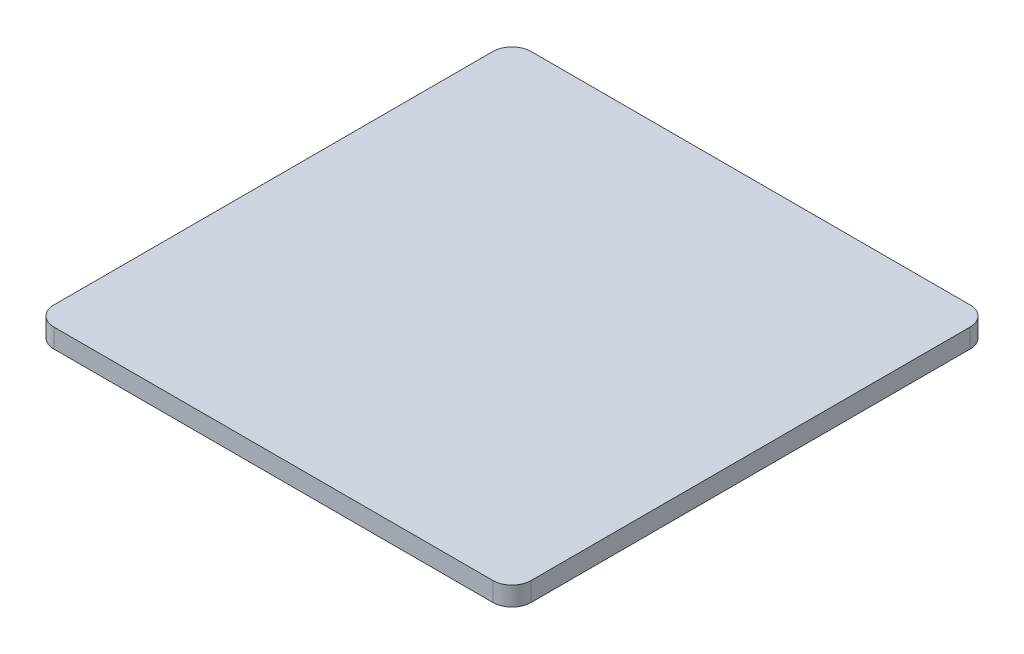
ISO-10303-21;
HEADER;
FILE_DESCRIPTION(('STEP AP214'),'2;1');
FILE_NAME('part.step','',(''),(''),'','','');
FILE_SCHEMA(('AUTOMOTIVE_DESIGN { 1 0 10303 214 1 1 1 1 }'));
ENDSEC;
DATA;
#1=APPLICATION_CONTEXT('core data for automotive mechanical design processes');
#2=APPLICATION_PROTOCOL_DEFINITION('international standard','automotive_design',2000,#1);
#3=PRODUCT_CONTEXT('',#1,'mechanical');
#4=PRODUCT('Part','Part','',(#3));
#5=PRODUCT_RELATED_PRODUCT_CATEGORY('part','',(#4));
#6=PRODUCT_DEFINITION_FORMATION('','',#4);
#7=PRODUCT_DEFINITION_CONTEXT('part definition',#1,'design');
#8=PRODUCT_DEFINITION('design','',#6,#7);
#9=PRODUCT_DEFINITION_SHAPE('','',#8);
#10=(LENGTH_UNIT() NAMED_UNIT(*) SI_UNIT(.MILLI.,.METRE.));
#11=(NAMED_UNIT(*) PLANE_ANGLE_UNIT() SI_UNIT($,.RADIAN.));
#12=(NAMED_UNIT(*) SI_UNIT($,.STERADIAN.) SOLID_ANGLE_UNIT());
#13=UNCERTAINTY_MEASURE_WITH_UNIT(LENGTH_MEASURE(1.E-05),#10,'distance_accuracy_value','');
#14=(GEOMETRIC_REPRESENTATION_CONTEXT(3) GLOBAL_UNCERTAINTY_ASSIGNED_CONTEXT((#13)) GLOBAL_UNIT_ASSIGNED_CONTEXT((#10,
#11,#12)) REPRESENTATION_CONTEXT('',''));
#15=CARTESIAN_POINT('',(0.,0.,0.));
#16=DIRECTION('',(0.,0.,1.));
#17=DIRECTION('',(1.,0.,0.));
#18=AXIS2_PLACEMENT_3D('',#15,#16,#17);
#19=CARTESIAN_POINT('',(-63.5,5.08,63.5));
#20=DIRECTION('',(1.,0.,0.));
#21=DIRECTION('',(0.,0.,-1.));
#22=AXIS2_PLACEMENT_3D('',#19,#20,#21);
#23=PLANE('',#22);
#24=DIRECTION('',(0.,0.,1.));
#25=VECTOR('',#24,1.);
#26=CARTESIAN_POINT('',(-63.5,5.08,63.5));
#27=LINE('',#26,#25);
#28=CARTESIAN_POINT('',(-63.5,5.08,-58.42));
#29=VERTEX_POINT('',#28);
#30=CARTESIAN_POINT('',(-63.5,5.08,58.42));
#31=VERTEX_POINT('',#30);
#32=EDGE_CURVE('E119',#29,#31,#27,.T.);
#33=ORIENTED_EDGE('',*,*,#32,.F.);
#34=DIRECTION('',(0.,-1.,0.));
#35=VECTOR('',#34,1.);
#36=CARTESIAN_POINT('',(-63.5,5.08,-58.42));
#37=LINE('',#36,#35);
#38=CARTESIAN_POINT('',(-63.5,0.,-58.42));
#39=VERTEX_POINT('',#38);
#40=EDGE_CURVE('E104',#29,#39,#37,.T.);
#41=ORIENTED_EDGE('',*,*,#40,.T.);
#42=DIRECTION('',(0.,0.,1.));
#43=VECTOR('',#42,1.);
#44=CARTESIAN_POINT('',(-63.5,0.,63.5));
#45=LINE('',#44,#43);
#46=CARTESIAN_POINT('',(-63.5,0.,58.42));
#47=VERTEX_POINT('',#46);
#48=EDGE_CURVE('E116',#39,#47,#45,.T.);
#49=ORIENTED_EDGE('',*,*,#48,.T.);
#50=DIRECTION('',(0.,-1.,0.));
#51=VECTOR('',#50,1.);
#52=CARTESIAN_POINT('',(-63.5,5.08,58.42));
#53=LINE('',#52,#51);
#54=EDGE_CURVE('E121',#47,#31,#53,.F.);
#55=ORIENTED_EDGE('',*,*,#54,.T.);
#56=EDGE_LOOP('',(#33,#41,#49,#55));
#57=FACE_BOUND('',#56,.T.);
#58=ADVANCED_FACE('F33',(#57),#23,.F.);
#59=CARTESIAN_POINT('',(63.5,5.08,63.5));
#60=DIRECTION('',(0.,0.,-1.));
#61=DIRECTION('',(-1.,0.,0.));
#62=AXIS2_PLACEMENT_3D('',#59,#60,#61);
#63=PLANE('',#62);
#64=DIRECTION('',(1.,0.,0.));
#65=VECTOR('',#64,1.);
#66=CARTESIAN_POINT('',(63.5,5.08,63.5));
#67=LINE('',#66,#65);
#68=CARTESIAN_POINT('',(-58.42,5.08,63.5));
#69=VERTEX_POINT('',#68);
#70=CARTESIAN_POINT('',(58.42,5.08,63.5));
#71=VERTEX_POINT('',#70);
#72=EDGE_CURVE('E159',#69,#71,#67,.T.);
#73=ORIENTED_EDGE('',*,*,#72,.F.);
#74=DIRECTION('',(0.,-1.,0.));
#75=VECTOR('',#74,1.);
#76=CARTESIAN_POINT('',(-58.42,5.08,63.5));
#77=LINE('',#76,#75);
#78=CARTESIAN_POINT('',(-58.42,0.,63.5));
#79=VERTEX_POINT('',#78);
#80=EDGE_CURVE('E11',#69,#79,#77,.T.);
#81=ORIENTED_EDGE('',*,*,#80,.T.);
#82=DIRECTION('',(1.,0.,0.));
#83=VECTOR('',#82,1.);
#84=CARTESIAN_POINT('',(63.5,0.,63.5));
#85=LINE('',#84,#83);
#86=CARTESIAN_POINT('',(58.42,0.,63.5));
#87=VERTEX_POINT('',#86);
#88=EDGE_CURVE('E126',#79,#87,#85,.T.);
#89=ORIENTED_EDGE('',*,*,#88,.T.);
#90=DIRECTION('',(0.,-1.,0.));
#91=VECTOR('',#90,1.);
#92=CARTESIAN_POINT('',(58.42,5.08,63.5));
#93=LINE('',#92,#91);
#94=EDGE_CURVE('E41',#87,#71,#93,.F.);
#95=ORIENTED_EDGE('',*,*,#94,.T.);
#96=EDGE_LOOP('',(#73,#81,#89,#95));
#97=FACE_BOUND('',#96,.T.);
#98=ADVANCED_FACE('F158',(#97),#63,.F.);
#99=CARTESIAN_POINT('',(63.5,5.08,63.5));
#100=DIRECTION('',(-1.,0.,0.));
#101=DIRECTION('',(0.,0.,1.));
#102=AXIS2_PLACEMENT_3D('',#99,#100,#101);
#103=PLANE('',#102);
#104=DIRECTION('',(0.,0.,-1.));
#105=VECTOR('',#104,1.);
#106=CARTESIAN_POINT('',(63.5,0.,63.5));
#107=LINE('',#106,#105);
#108=CARTESIAN_POINT('',(63.5,0.,58.42));
#109=VERTEX_POINT('',#108);
#110=CARTESIAN_POINT('',(63.5,0.,-58.42));
#111=VERTEX_POINT('',#110);
#112=EDGE_CURVE('E129',#109,#111,#107,.T.);
#113=ORIENTED_EDGE('',*,*,#112,.T.);
#114=DIRECTION('',(0.,-1.,0.));
#115=VECTOR('',#114,1.);
#116=CARTESIAN_POINT('',(63.5,5.08,-58.42));
#117=LINE('',#116,#115);
#118=CARTESIAN_POINT('',(63.5,5.08,-58.42));
#119=VERTEX_POINT('',#118);
#120=EDGE_CURVE('E48',#111,#119,#117,.F.);
#121=ORIENTED_EDGE('',*,*,#120,.T.);
#122=DIRECTION('',(0.,0.,-1.));
#123=VECTOR('',#122,1.);
#124=CARTESIAN_POINT('',(63.5,5.08,63.5));
#125=LINE('',#124,#123);
#126=CARTESIAN_POINT('',(63.5,5.08,58.42));
#127=VERTEX_POINT('',#126);
#128=EDGE_CURVE('E165',#127,#119,#125,.T.);
#129=ORIENTED_EDGE('',*,*,#128,.F.);
#130=DIRECTION('',(0.,-1.,0.));
#131=VECTOR('',#130,1.);
#132=CARTESIAN_POINT('',(63.5,5.08,58.42));
#133=LINE('',#132,#131);
#134=EDGE_CURVE('E152',#127,#109,#133,.T.);
#135=ORIENTED_EDGE('',*,*,#134,.T.);
#136=EDGE_LOOP('',(#113,#121,#129,#135));
#137=FACE_BOUND('',#136,.T.);
#138=ADVANCED_FACE('F169',(#137),#103,.F.);
#139=CARTESIAN_POINT('',(63.5,5.08,-63.5));
#140=DIRECTION('',(0.,0.,1.));
#141=DIRECTION('',(1.,0.,0.));
#142=AXIS2_PLACEMENT_3D('',#139,#140,#141);
#143=PLANE('',#142);
#144=DIRECTION('',(-1.,0.,0.));
#145=VECTOR('',#144,1.);
#146=CARTESIAN_POINT('',(63.5,0.,-63.5));
#147=LINE('',#146,#145);
#148=CARTESIAN_POINT('',(58.42,0.,-63.5));
#149=VERTEX_POINT('',#148);
#150=CARTESIAN_POINT('',(-58.42,0.,-63.5));
#151=VERTEX_POINT('',#150);
#152=EDGE_CURVE('E136',#149,#151,#147,.T.);
#153=ORIENTED_EDGE('',*,*,#152,.T.);
#154=DIRECTION('',(0.,-1.,0.));
#155=VECTOR('',#154,1.);
#156=CARTESIAN_POINT('',(-58.42,5.08,-63.5));
#157=LINE('',#156,#155);
#158=CARTESIAN_POINT('',(-58.42,5.08,-63.5));
#159=VERTEX_POINT('',#158);
#160=EDGE_CURVE('E105',#151,#159,#157,.F.);
#161=ORIENTED_EDGE('',*,*,#160,.T.);
#162=DIRECTION('',(-1.,0.,0.));
#163=VECTOR('',#162,1.);
#164=CARTESIAN_POINT('',(63.5,5.08,-63.5));
#165=LINE('',#164,#163);
#166=CARTESIAN_POINT('',(58.42,5.08,-63.5));
#167=VERTEX_POINT('',#166);
#168=EDGE_CURVE('E132',#167,#159,#165,.T.);
#169=ORIENTED_EDGE('',*,*,#168,.F.);
#170=DIRECTION('',(0.,-1.,0.));
#171=VECTOR('',#170,1.);
#172=CARTESIAN_POINT('',(58.42,5.08,-63.5));
#173=LINE('',#172,#171);
#174=EDGE_CURVE('E110',#167,#149,#173,.T.);
#175=ORIENTED_EDGE('',*,*,#174,.T.);
#176=EDGE_LOOP('',(#153,#161,#169,#175));
#177=FACE_BOUND('',#176,.T.);
#178=ADVANCED_FACE('F176',(#177),#143,.F.);
#179=CARTESIAN_POINT('',(0.,5.08,0.));
#180=DIRECTION('',(0.,1.,0.));
#181=DIRECTION('',(0.,0.,1.));
#182=AXIS2_PLACEMENT_3D('',#179,#180,#181);
#183=PLANE('',#182);
#184=ORIENTED_EDGE('',*,*,#168,.T.);
#185=CARTESIAN_POINT('',(-58.42,5.08,-58.42));
#186=DIRECTION('',(0.,1.,0.));
#187=DIRECTION('',(0.,0.,1.));
#188=AXIS2_PLACEMENT_3D('',#185,#186,#187);
#189=CIRCLE('',#188,5.08);
#190=EDGE_CURVE('E150',#159,#29,#189,.T.);
#191=ORIENTED_EDGE('',*,*,#190,.T.);
#192=ORIENTED_EDGE('',*,*,#32,.T.);
#193=CARTESIAN_POINT('',(-58.42,5.08,58.42));
#194=DIRECTION('',(0.,1.,0.));
#195=DIRECTION('',(0.,0.,1.));
#196=AXIS2_PLACEMENT_3D('',#193,#194,#195);
#197=CIRCLE('',#196,5.08);
#198=EDGE_CURVE('E146',#31,#69,#197,.T.);
#199=ORIENTED_EDGE('',*,*,#198,.T.);
#200=ORIENTED_EDGE('',*,*,#72,.T.);
#201=CARTESIAN_POINT('',(58.42,5.08,58.42));
#202=DIRECTION('',(0.,1.,0.));
#203=DIRECTION('',(0.,0.,1.));
#204=AXIS2_PLACEMENT_3D('',#201,#202,#203);
#205=CIRCLE('',#204,5.08);
#206=EDGE_CURVE('E55',#71,#127,#205,.T.);
#207=ORIENTED_EDGE('',*,*,#206,.T.);
#208=ORIENTED_EDGE('',*,*,#128,.T.);
#209=CARTESIAN_POINT('',(58.42,5.08,-58.42));
#210=DIRECTION('',(0.,1.,0.));
#211=DIRECTION('',(0.,0.,1.));
#212=AXIS2_PLACEMENT_3D('',#209,#210,#211);
#213=CIRCLE('',#212,5.08);
#214=EDGE_CURVE('E148',#119,#167,#213,.T.);
#215=ORIENTED_EDGE('',*,*,#214,.T.);
#216=EDGE_LOOP('',(#184,#191,#192,#199,#200,#207,#208,#215));
#217=FACE_BOUND('',#216,.T.);
#218=ADVANCED_FACE('F163',(#217),#183,.T.);
#219=CARTESIAN_POINT('',(0.,0.,0.));
#220=DIRECTION('',(0.,1.,0.));
#221=DIRECTION('',(0.,0.,1.));
#222=AXIS2_PLACEMENT_3D('',#219,#220,#221);
#223=PLANE('',#222);
#224=ORIENTED_EDGE('',*,*,#48,.F.);
#225=CARTESIAN_POINT('',(-58.42,0.,-58.42));
#226=DIRECTION('',(0.,1.,0.));
#227=DIRECTION('',(0.,0.,1.));
#228=AXIS2_PLACEMENT_3D('',#225,#226,#227);
#229=CIRCLE('',#228,5.08);
#230=EDGE_CURVE('E100',#39,#151,#229,.F.);
#231=ORIENTED_EDGE('',*,*,#230,.T.);
#232=ORIENTED_EDGE('',*,*,#152,.F.);
#233=CARTESIAN_POINT('',(58.42,0.,-58.42));
#234=DIRECTION('',(0.,1.,0.));
#235=DIRECTION('',(0.,0.,1.));
#236=AXIS2_PLACEMENT_3D('',#233,#234,#235);
#237=CIRCLE('',#236,5.08);
#238=EDGE_CURVE('E111',#149,#111,#237,.F.);
#239=ORIENTED_EDGE('',*,*,#238,.T.);
#240=ORIENTED_EDGE('',*,*,#112,.F.);
#241=CARTESIAN_POINT('',(58.42,0.,58.42));
#242=DIRECTION('',(0.,1.,0.));
#243=DIRECTION('',(0.,0.,1.));
#244=AXIS2_PLACEMENT_3D('',#241,#242,#243);
#245=CIRCLE('',#244,5.08);
#246=EDGE_CURVE('E120',#109,#87,#245,.F.);
#247=ORIENTED_EDGE('',*,*,#246,.T.);
#248=ORIENTED_EDGE('',*,*,#88,.F.);
#249=CARTESIAN_POINT('',(-58.42,0.,58.42));
#250=DIRECTION('',(0.,1.,0.));
#251=DIRECTION('',(0.,0.,1.));
#252=AXIS2_PLACEMENT_3D('',#249,#250,#251);
#253=CIRCLE('',#252,5.08);
#254=EDGE_CURVE('E125',#79,#47,#253,.F.);
#255=ORIENTED_EDGE('',*,*,#254,.T.);
#256=EDGE_LOOP('',(#224,#231,#232,#239,#240,#247,#248,#255));
#257=FACE_BOUND('',#256,.T.);
#258=ADVANCED_FACE('F123',(#257),#223,.F.);
#259=CARTESIAN_POINT('',(-58.42,5.08,-58.42));
#260=DIRECTION('',(0.,-1.,0.));
#261=DIRECTION('',(0.,0.,-1.));
#262=AXIS2_PLACEMENT_3D('',#259,#260,#261);
#263=CYLINDRICAL_SURFACE('',#262,5.08);
#264=ORIENTED_EDGE('',*,*,#190,.F.);
#265=ORIENTED_EDGE('',*,*,#160,.F.);
#266=ORIENTED_EDGE('',*,*,#230,.F.);
#267=ORIENTED_EDGE('',*,*,#40,.F.);
#268=EDGE_LOOP('',(#264,#265,#266,#267));
#269=FACE_BOUND('',#268,.T.);
#270=ADVANCED_FACE('F103',(#269),#263,.T.);
#271=CARTESIAN_POINT('',(58.42,5.08,-58.42));
#272=DIRECTION('',(0.,-1.,0.));
#273=DIRECTION('',(0.,0.,-1.));
#274=AXIS2_PLACEMENT_3D('',#271,#272,#273);
#275=CYLINDRICAL_SURFACE('',#274,5.08);
#276=ORIENTED_EDGE('',*,*,#214,.F.);
#277=ORIENTED_EDGE('',*,*,#120,.F.);
#278=ORIENTED_EDGE('',*,*,#238,.F.);
#279=ORIENTED_EDGE('',*,*,#174,.F.);
#280=EDGE_LOOP('',(#276,#277,#278,#279));
#281=FACE_BOUND('',#280,.T.);
#282=ADVANCED_FACE('F173',(#281),#275,.T.);
#283=CARTESIAN_POINT('',(-58.42,5.08,58.42));
#284=DIRECTION('',(0.,-1.,0.));
#285=DIRECTION('',(0.,0.,-1.));
#286=AXIS2_PLACEMENT_3D('',#283,#284,#285);
#287=CYLINDRICAL_SURFACE('',#286,5.08);
#288=ORIENTED_EDGE('',*,*,#198,.F.);
#289=ORIENTED_EDGE('',*,*,#54,.F.);
#290=ORIENTED_EDGE('',*,*,#254,.F.);
#291=ORIENTED_EDGE('',*,*,#80,.F.);
#292=EDGE_LOOP('',(#288,#289,#290,#291));
#293=FACE_BOUND('',#292,.T.);
#294=ADVANCED_FACE('F179',(#293),#287,.T.);
#295=CARTESIAN_POINT('',(58.42,5.08,58.42));
#296=DIRECTION('',(0.,-1.,0.));
#297=DIRECTION('',(0.,0.,-1.));
#298=AXIS2_PLACEMENT_3D('',#295,#296,#297);
#299=CYLINDRICAL_SURFACE('',#298,5.08);
#300=ORIENTED_EDGE('',*,*,#206,.F.);
#301=ORIENTED_EDGE('',*,*,#94,.F.);
#302=ORIENTED_EDGE('',*,*,#246,.F.);
#303=ORIENTED_EDGE('',*,*,#134,.F.);
#304=EDGE_LOOP('',(#300,#301,#302,#303));
#305=FACE_BOUND('',#304,.T.);
#306=ADVANCED_FACE('F35',(#305),#299,.T.);
#307=CLOSED_SHELL('',(#58,#98,#138,#178,#218,#258,#270,#282,#294,#306));
#308=MANIFOLD_SOLID_BREP('B2',#307);
#309=ADVANCED_BREP_SHAPE_REPRESENTATION('',(#18,#308),#14);
#310=SHAPE_DEFINITION_REPRESENTATION(#9,#309);
ENDSEC;
END-ISO-10303-21;
